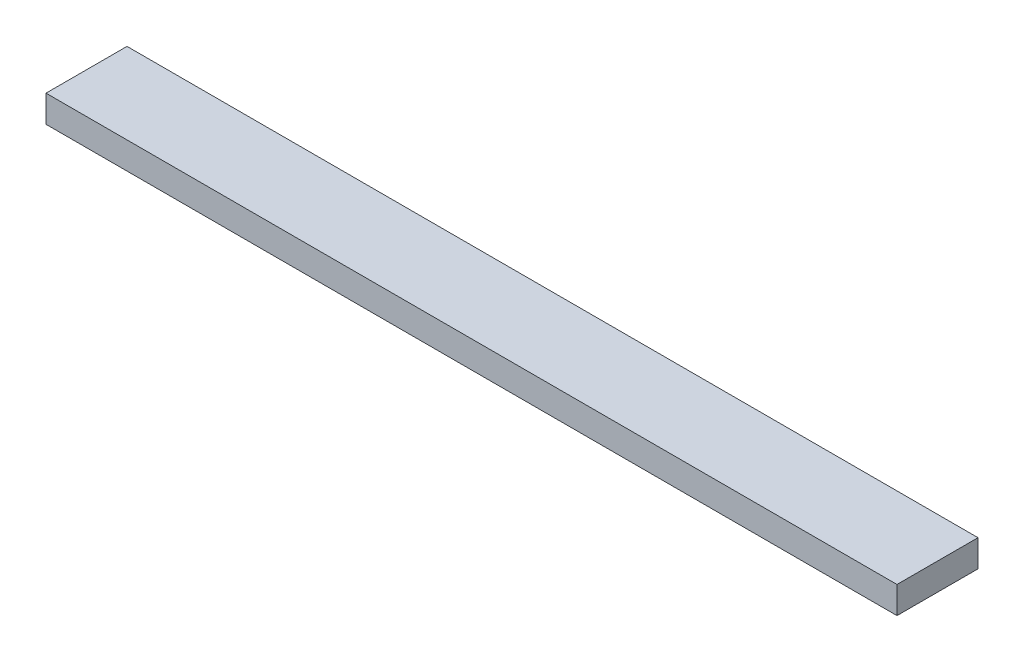
ISO-10303-21;
HEADER;
FILE_DESCRIPTION(('STEP AP214'),'2;1');
FILE_NAME('part.step','',(''),(''),'','','');
FILE_SCHEMA(('AUTOMOTIVE_DESIGN { 1 0 10303 214 1 1 1 1 }'));
ENDSEC;
DATA;
#1=APPLICATION_CONTEXT('core data for automotive mechanical design processes');
#2=APPLICATION_PROTOCOL_DEFINITION('international standard','automotive_design',2000,#1);
#3=PRODUCT_CONTEXT('',#1,'mechanical');
#4=PRODUCT('Part','Part','',(#3));
#5=PRODUCT_RELATED_PRODUCT_CATEGORY('part','',(#4));
#6=PRODUCT_DEFINITION_FORMATION('','',#4);
#7=PRODUCT_DEFINITION_CONTEXT('part definition',#1,'design');
#8=PRODUCT_DEFINITION('design','',#6,#7);
#9=PRODUCT_DEFINITION_SHAPE('','',#8);
#10=(LENGTH_UNIT() NAMED_UNIT(*) SI_UNIT(.MILLI.,.METRE.));
#11=(NAMED_UNIT(*) PLANE_ANGLE_UNIT() SI_UNIT($,.RADIAN.));
#12=(NAMED_UNIT(*) SI_UNIT($,.STERADIAN.) SOLID_ANGLE_UNIT());
#13=UNCERTAINTY_MEASURE_WITH_UNIT(LENGTH_MEASURE(1.E-05),#10,'distance_accuracy_value','');
#14=(GEOMETRIC_REPRESENTATION_CONTEXT(3) GLOBAL_UNCERTAINTY_ASSIGNED_CONTEXT((#13)) GLOBAL_UNIT_ASSIGNED_CONTEXT((#10,
#11,#12)) REPRESENTATION_CONTEXT('',''));
#15=CARTESIAN_POINT('',(0.,0.,0.));
#16=DIRECTION('',(0.,0.,1.));
#17=DIRECTION('',(1.,0.,0.));
#18=AXIS2_PLACEMENT_3D('',#15,#16,#17);
#19=CARTESIAN_POINT('',(400.2,0.,0.));
#20=DIRECTION('',(0.,0.,-1.));
#21=DIRECTION('',(-1.,0.,0.));
#22=AXIS2_PLACEMENT_3D('',#19,#20,#21);
#23=PLANE('',#22);
#24=DIRECTION('',(0.,-1.,0.));
#25=VECTOR('',#24,1.);
#26=CARTESIAN_POINT('',(0.,0.,0.));
#27=LINE('',#26,#25);
#28=CARTESIAN_POINT('',(0.,12.7,0.));
#29=VERTEX_POINT('',#28);
#30=CARTESIAN_POINT('',(0.,0.,0.));
#31=VERTEX_POINT('',#30);
#32=EDGE_CURVE('E107',#29,#31,#27,.T.);
#33=ORIENTED_EDGE('',*,*,#32,.T.);
#34=DIRECTION('',(-1.,0.,0.));
#35=VECTOR('',#34,1.);
#36=CARTESIAN_POINT('',(400.2,0.,0.));
#37=LINE('',#36,#35);
#38=CARTESIAN_POINT('',(400.2,0.,0.));
#39=VERTEX_POINT('',#38);
#40=EDGE_CURVE('E11',#39,#31,#37,.T.);
#41=ORIENTED_EDGE('',*,*,#40,.F.);
#42=DIRECTION('',(0.,-1.,0.));
#43=VECTOR('',#42,1.);
#44=CARTESIAN_POINT('',(400.2,0.,0.));
#45=LINE('',#44,#43);
#46=CARTESIAN_POINT('',(400.2,12.7,0.));
#47=VERTEX_POINT('',#46);
#48=EDGE_CURVE('E91',#47,#39,#45,.T.);
#49=ORIENTED_EDGE('',*,*,#48,.F.);
#50=DIRECTION('',(-1.,0.,0.));
#51=VECTOR('',#50,1.);
#52=CARTESIAN_POINT('',(400.2,12.7,0.));
#53=LINE('',#52,#51);
#54=EDGE_CURVE('E103',#47,#29,#53,.T.);
#55=ORIENTED_EDGE('',*,*,#54,.T.);
#56=EDGE_LOOP('',(#33,#41,#49,#55));
#57=FACE_BOUND('',#56,.T.);
#58=ADVANCED_FACE('F39',(#57),#23,.F.);
#59=CARTESIAN_POINT('',(400.2,0.,0.));
#60=DIRECTION('',(0.,1.,0.));
#61=DIRECTION('',(0.,0.,1.));
#62=AXIS2_PLACEMENT_3D('',#59,#60,#61);
#63=PLANE('',#62);
#64=DIRECTION('',(0.,0.,-1.));
#65=VECTOR('',#64,1.);
#66=CARTESIAN_POINT('',(0.,0.,0.));
#67=LINE('',#66,#65);
#68=CARTESIAN_POINT('',(0.,0.,-38.1));
#69=VERTEX_POINT('',#68);
#70=EDGE_CURVE('E96',#31,#69,#67,.T.);
#71=ORIENTED_EDGE('',*,*,#70,.T.);
#72=DIRECTION('',(-1.,0.,0.));
#73=VECTOR('',#72,1.);
#74=CARTESIAN_POINT('',(400.2,0.,-38.1));
#75=LINE('',#74,#73);
#76=CARTESIAN_POINT('',(400.2,0.,-38.1));
#77=VERTEX_POINT('',#76);
#78=EDGE_CURVE('E48',#77,#69,#75,.T.);
#79=ORIENTED_EDGE('',*,*,#78,.F.);
#80=DIRECTION('',(0.,0.,-1.));
#81=VECTOR('',#80,1.);
#82=CARTESIAN_POINT('',(400.2,0.,0.));
#83=LINE('',#82,#81);
#84=EDGE_CURVE('E86',#39,#77,#83,.T.);
#85=ORIENTED_EDGE('',*,*,#84,.F.);
#86=ORIENTED_EDGE('',*,*,#40,.T.);
#87=EDGE_LOOP('',(#71,#79,#85,#86));
#88=FACE_BOUND('',#87,.T.);
#89=ADVANCED_FACE('F95',(#88),#63,.F.);
#90=CARTESIAN_POINT('',(400.2,0.,-38.1));
#91=DIRECTION('',(0.,0.,1.));
#92=DIRECTION('',(0.,-1.,0.));
#93=AXIS2_PLACEMENT_3D('',#90,#91,#92);
#94=PLANE('',#93);
#95=DIRECTION('',(0.,1.,0.));
#96=VECTOR('',#95,1.);
#97=CARTESIAN_POINT('',(0.,0.,-38.1));
#98=LINE('',#97,#96);
#99=CARTESIAN_POINT('',(0.,12.7,-38.1));
#100=VERTEX_POINT('',#99);
#101=EDGE_CURVE('E73',#69,#100,#98,.T.);
#102=ORIENTED_EDGE('',*,*,#101,.T.);
#103=DIRECTION('',(-1.,0.,0.));
#104=VECTOR('',#103,1.);
#105=CARTESIAN_POINT('',(400.2,12.7,-38.1));
#106=LINE('',#105,#104);
#107=CARTESIAN_POINT('',(400.2,12.7,-38.1));
#108=VERTEX_POINT('',#107);
#109=EDGE_CURVE('E98',#108,#100,#106,.T.);
#110=ORIENTED_EDGE('',*,*,#109,.F.);
#111=DIRECTION('',(0.,1.,0.));
#112=VECTOR('',#111,1.);
#113=CARTESIAN_POINT('',(400.2,0.,-38.1));
#114=LINE('',#113,#112);
#115=EDGE_CURVE('E89',#77,#108,#114,.T.);
#116=ORIENTED_EDGE('',*,*,#115,.F.);
#117=ORIENTED_EDGE('',*,*,#78,.T.);
#118=EDGE_LOOP('',(#102,#110,#116,#117));
#119=FACE_BOUND('',#118,.T.);
#120=ADVANCED_FACE('F99',(#119),#94,.F.);
#121=CARTESIAN_POINT('',(400.2,12.7,0.));
#122=DIRECTION('',(0.,-1.,0.));
#123=DIRECTION('',(0.,0.,-1.));
#124=AXIS2_PLACEMENT_3D('',#121,#122,#123);
#125=PLANE('',#124);
#126=DIRECTION('',(0.,0.,1.));
#127=VECTOR('',#126,1.);
#128=CARTESIAN_POINT('',(0.,12.7,0.));
#129=LINE('',#128,#127);
#130=EDGE_CURVE('E79',#100,#29,#129,.T.);
#131=ORIENTED_EDGE('',*,*,#130,.T.);
#132=ORIENTED_EDGE('',*,*,#54,.F.);
#133=DIRECTION('',(0.,0.,1.));
#134=VECTOR('',#133,1.);
#135=CARTESIAN_POINT('',(400.2,12.7,0.));
#136=LINE('',#135,#134);
#137=EDGE_CURVE('E56',#108,#47,#136,.T.);
#138=ORIENTED_EDGE('',*,*,#137,.F.);
#139=ORIENTED_EDGE('',*,*,#109,.T.);
#140=EDGE_LOOP('',(#131,#132,#138,#139));
#141=FACE_BOUND('',#140,.T.);
#142=ADVANCED_FACE('F120',(#141),#125,.F.);
#143=CARTESIAN_POINT('',(400.2,0.,0.));
#144=DIRECTION('',(-1.,0.,0.));
#145=DIRECTION('',(0.,0.,1.));
#146=AXIS2_PLACEMENT_3D('',#143,#144,#145);
#147=PLANE('',#146);
#148=ORIENTED_EDGE('',*,*,#48,.T.);
#149=ORIENTED_EDGE('',*,*,#84,.T.);
#150=ORIENTED_EDGE('',*,*,#115,.T.);
#151=ORIENTED_EDGE('',*,*,#137,.T.);
#152=EDGE_LOOP('',(#148,#149,#150,#151));
#153=FACE_BOUND('',#152,.T.);
#154=ADVANCED_FACE('F87',(#153),#147,.F.);
#155=CARTESIAN_POINT('',(0.,0.,0.));
#156=DIRECTION('',(-1.,0.,0.));
#157=DIRECTION('',(0.,0.,1.));
#158=AXIS2_PLACEMENT_3D('',#155,#156,#157);
#159=PLANE('',#158);
#160=ORIENTED_EDGE('',*,*,#32,.F.);
#161=ORIENTED_EDGE('',*,*,#130,.F.);
#162=ORIENTED_EDGE('',*,*,#101,.F.);
#163=ORIENTED_EDGE('',*,*,#70,.F.);
#164=EDGE_LOOP('',(#160,#161,#162,#163));
#165=FACE_BOUND('',#164,.T.);
#166=ADVANCED_FACE('F123',(#165),#159,.T.);
#167=CLOSED_SHELL('',(#58,#89,#120,#142,#154,#166));
#168=MANIFOLD_SOLID_BREP('B2',#167);
#169=ADVANCED_BREP_SHAPE_REPRESENTATION('',(#18,#168),#14);
#170=SHAPE_DEFINITION_REPRESENTATION(#9,#169);
ENDSEC;
END-ISO-10303-21;
